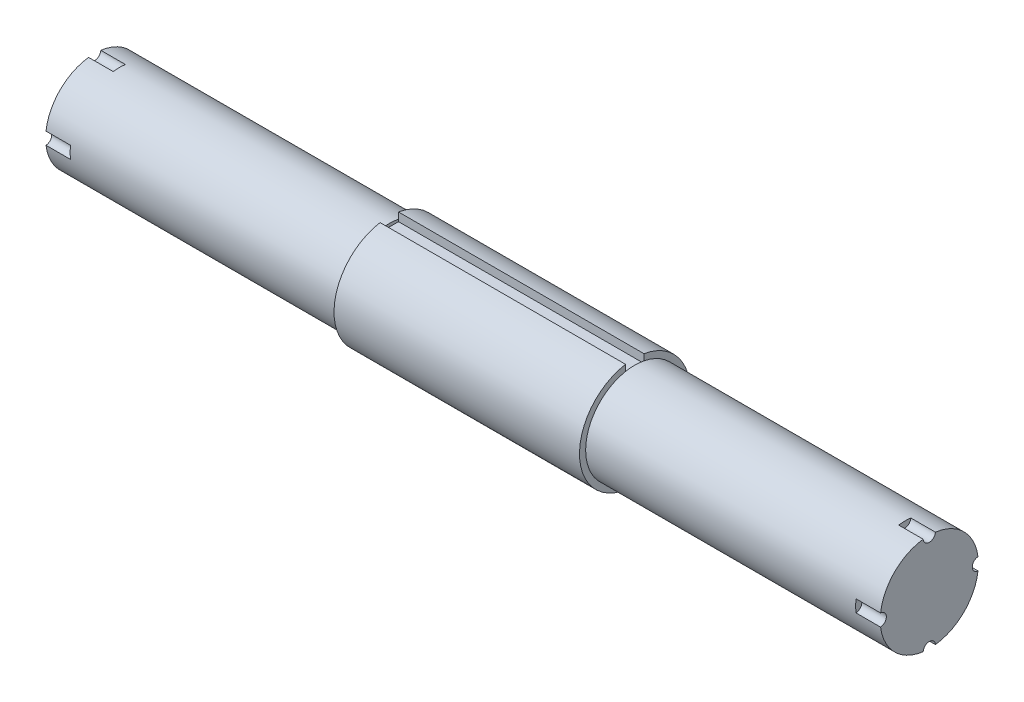
ISO-10303-21;
HEADER;
FILE_DESCRIPTION(('STEP AP214'),'2;1');
FILE_NAME('part.step','',(''),(''),'','','');
FILE_SCHEMA(('AUTOMOTIVE_DESIGN { 1 0 10303 214 1 1 1 1 }'));
ENDSEC;
DATA;
#1=APPLICATION_CONTEXT('core data for automotive mechanical design processes');
#2=APPLICATION_PROTOCOL_DEFINITION('international standard','automotive_design',2000,#1);
#3=PRODUCT_CONTEXT('',#1,'mechanical');
#4=PRODUCT('Part','Part','',(#3));
#5=PRODUCT_RELATED_PRODUCT_CATEGORY('part','',(#4));
#6=PRODUCT_DEFINITION_FORMATION('','',#4);
#7=PRODUCT_DEFINITION_CONTEXT('part definition',#1,'design');
#8=PRODUCT_DEFINITION('design','',#6,#7);
#9=PRODUCT_DEFINITION_SHAPE('','',#8);
#10=(LENGTH_UNIT() NAMED_UNIT(*) SI_UNIT(.MILLI.,.METRE.));
#11=(NAMED_UNIT(*) PLANE_ANGLE_UNIT() SI_UNIT($,.RADIAN.));
#12=(NAMED_UNIT(*) SI_UNIT($,.STERADIAN.) SOLID_ANGLE_UNIT());
#13=UNCERTAINTY_MEASURE_WITH_UNIT(LENGTH_MEASURE(1.E-05),#10,'distance_accuracy_value','');
#14=(GEOMETRIC_REPRESENTATION_CONTEXT(3) GLOBAL_UNCERTAINTY_ASSIGNED_CONTEXT((#13)) GLOBAL_UNIT_ASSIGNED_CONTEXT((#10,
#11,#12)) REPRESENTATION_CONTEXT('',''));
#15=CARTESIAN_POINT('',(0.,0.,0.));
#16=DIRECTION('',(0.,0.,1.));
#17=DIRECTION('',(1.,0.,0.));
#18=AXIS2_PLACEMENT_3D('',#15,#16,#17);
#19=CARTESIAN_POINT('',(-107.95,0.,0.));
#20=DIRECTION('',(1.,0.,0.));
#21=DIRECTION('',(0.,0.,-1.));
#22=AXIS2_PLACEMENT_3D('',#19,#20,#21);
#23=CYLINDRICAL_SURFACE('',#22,12.7);
#24=CARTESIAN_POINT('',(-31.75,0.,0.));
#25=DIRECTION('',(-1.,0.,0.));
#26=DIRECTION('',(0.,0.,1.));
#27=AXIS2_PLACEMENT_3D('',#24,#25,#26);
#28=CIRCLE('',#27,12.7);
#29=CARTESIAN_POINT('',(-31.75,12.474760456117,2.38125));
#30=VERTEX_POINT('',#29);
#31=CARTESIAN_POINT('',(-31.75,12.474760456117,-2.38125));
#32=VERTEX_POINT('',#31);
#33=EDGE_CURVE('E276',#30,#32,#28,.T.);
#34=ORIENTED_EDGE('',*,*,#33,.T.);
#35=EDGE_CURVE('E283',#32,#30,#28,.T.);
#36=ORIENTED_EDGE('',*,*,#35,.T.);
#37=EDGE_LOOP('',(#34,#36));
#38=FACE_BOUND('',#37,.T.);
#39=DIRECTION('',(-1.,0.,0.));
#40=VECTOR('',#39,1.);
#41=CARTESIAN_POINT('',(-104.775,1.5843963802183,-12.60078125));
#42=LINE('',#41,#40);
#43=CARTESIAN_POINT('',(-107.95,1.5843963802183,-12.60078125));
#44=VERTEX_POINT('',#43);
#45=CARTESIAN_POINT('',(-101.6,1.5843963802183,-12.60078125));
#46=VERTEX_POINT('',#45);
#47=EDGE_CURVE('E185',#44,#46,#42,.F.);
#48=ORIENTED_EDGE('',*,*,#47,.F.);
#49=CARTESIAN_POINT('',(-107.95,0.,0.));
#50=DIRECTION('',(-1.,0.,0.));
#51=DIRECTION('',(0.,0.,1.));
#52=AXIS2_PLACEMENT_3D('',#49,#50,#51);
#53=CIRCLE('',#52,12.7);
#54=CARTESIAN_POINT('',(-107.95,12.60078125,-1.58439638021818));
#55=VERTEX_POINT('',#54);
#56=EDGE_CURVE('E277',#55,#44,#53,.T.);
#57=ORIENTED_EDGE('',*,*,#56,.F.);
#58=DIRECTION('',(-1.,0.,0.));
#59=VECTOR('',#58,1.);
#60=CARTESIAN_POINT('',(-104.775,12.60078125,-1.58439638021817));
#61=LINE('',#60,#59);
#62=CARTESIAN_POINT('',(-101.6,12.60078125,-1.58439638021817));
#63=VERTEX_POINT('',#62);
#64=EDGE_CURVE('E225',#63,#55,#61,.T.);
#65=ORIENTED_EDGE('',*,*,#64,.F.);
#66=CARTESIAN_POINT('',(-101.6,0.,0.));
#67=DIRECTION('',(-1.,0.,0.));
#68=DIRECTION('',(0.,0.,1.));
#69=AXIS2_PLACEMENT_3D('',#66,#67,#68);
#70=CIRCLE('',#69,12.7);
#71=CARTESIAN_POINT('',(-101.6,12.60078125,1.58439638021817));
#72=VERTEX_POINT('',#71);
#73=EDGE_CURVE('E336',#72,#63,#70,.T.);
#74=ORIENTED_EDGE('',*,*,#73,.F.);
#75=DIRECTION('',(-1.,0.,0.));
#76=VECTOR('',#75,1.);
#77=CARTESIAN_POINT('',(-104.775,12.60078125,1.58439638021817));
#78=LINE('',#77,#76);
#79=CARTESIAN_POINT('',(-107.95,12.60078125,1.58439638021817));
#80=VERTEX_POINT('',#79);
#81=EDGE_CURVE('E229',#80,#72,#78,.F.);
#82=ORIENTED_EDGE('',*,*,#81,.F.);
#83=CARTESIAN_POINT('',(-107.95,1.58439638021813,12.60078125));
#84=VERTEX_POINT('',#83);
#85=EDGE_CURVE('E280',#84,#80,#53,.T.);
#86=ORIENTED_EDGE('',*,*,#85,.F.);
#87=DIRECTION('',(-1.,0.,0.));
#88=VECTOR('',#87,1.);
#89=CARTESIAN_POINT('',(-104.775,1.58439638021813,12.60078125));
#90=LINE('',#89,#88);
#91=CARTESIAN_POINT('',(-101.6,1.58439638021813,12.60078125));
#92=VERTEX_POINT('',#91);
#93=EDGE_CURVE('E215',#92,#84,#90,.T.);
#94=ORIENTED_EDGE('',*,*,#93,.F.);
#95=CARTESIAN_POINT('',(-101.6,0.,0.));
#96=DIRECTION('',(-1.,0.,0.));
#97=DIRECTION('',(0.,0.,1.));
#98=AXIS2_PLACEMENT_3D('',#95,#96,#97);
#99=CIRCLE('',#98,12.7);
#100=CARTESIAN_POINT('',(-101.6,-1.58439638021821,12.60078125));
#101=VERTEX_POINT('',#100);
#102=EDGE_CURVE('E338',#101,#92,#99,.T.);
#103=ORIENTED_EDGE('',*,*,#102,.F.);
#104=DIRECTION('',(-1.,0.,0.));
#105=VECTOR('',#104,1.);
#106=CARTESIAN_POINT('',(-104.775,-1.58439638021821,12.60078125));
#107=LINE('',#106,#105);
#108=CARTESIAN_POINT('',(-107.95,-1.58439638021821,12.60078125));
#109=VERTEX_POINT('',#108);
#110=EDGE_CURVE('E219',#109,#101,#107,.F.);
#111=ORIENTED_EDGE('',*,*,#110,.F.);
#112=CARTESIAN_POINT('',(-107.95,-12.60078125,1.58439638021818));
#113=VERTEX_POINT('',#112);
#114=EDGE_CURVE('E346',#113,#109,#53,.T.);
#115=ORIENTED_EDGE('',*,*,#114,.F.);
#116=DIRECTION('',(-1.,0.,0.));
#117=VECTOR('',#116,1.);
#118=CARTESIAN_POINT('',(-104.775,-12.60078125,1.58439638021817));
#119=LINE('',#118,#117);
#120=CARTESIAN_POINT('',(-101.6,-12.60078125,1.58439638021817));
#121=VERTEX_POINT('',#120);
#122=EDGE_CURVE('E59',#121,#113,#119,.T.);
#123=ORIENTED_EDGE('',*,*,#122,.F.);
#124=CARTESIAN_POINT('',(-101.6,0.,0.));
#125=DIRECTION('',(-1.,0.,0.));
#126=DIRECTION('',(0.,0.,1.));
#127=AXIS2_PLACEMENT_3D('',#124,#125,#126);
#128=CIRCLE('',#127,12.7);
#129=CARTESIAN_POINT('',(-101.6,-12.60078125,-1.58439638021817));
#130=VERTEX_POINT('',#129);
#131=EDGE_CURVE('E44',#130,#121,#128,.T.);
#132=ORIENTED_EDGE('',*,*,#131,.F.);
#133=DIRECTION('',(-1.,0.,0.));
#134=VECTOR('',#133,1.);
#135=CARTESIAN_POINT('',(-104.775,-12.60078125,-1.58439638021817));
#136=LINE('',#135,#134);
#137=CARTESIAN_POINT('',(-107.95,-12.60078125,-1.58439638021817));
#138=VERTEX_POINT('',#137);
#139=EDGE_CURVE('E209',#138,#130,#136,.F.);
#140=ORIENTED_EDGE('',*,*,#139,.F.);
#141=CARTESIAN_POINT('',(-107.95,-1.58439638021805,-12.60078125));
#142=VERTEX_POINT('',#141);
#143=EDGE_CURVE('E201',#142,#138,#53,.T.);
#144=ORIENTED_EDGE('',*,*,#143,.F.);
#145=DIRECTION('',(-1.,0.,0.));
#146=VECTOR('',#145,1.);
#147=CARTESIAN_POINT('',(-104.775,-1.58439638021804,-12.60078125));
#148=LINE('',#147,#146);
#149=CARTESIAN_POINT('',(-101.6,-1.58439638021804,-12.60078125));
#150=VERTEX_POINT('',#149);
#151=EDGE_CURVE('E51',#150,#142,#148,.T.);
#152=ORIENTED_EDGE('',*,*,#151,.F.);
#153=CARTESIAN_POINT('',(-101.6,0.,0.));
#154=DIRECTION('',(-1.,0.,0.));
#155=DIRECTION('',(0.,0.,1.));
#156=AXIS2_PLACEMENT_3D('',#153,#154,#155);
#157=CIRCLE('',#156,12.7);
#158=EDGE_CURVE('E11',#46,#150,#157,.T.);
#159=ORIENTED_EDGE('',*,*,#158,.F.);
#160=EDGE_LOOP('',(#48,#57,#65,#74,#82,#86,#94,#103,#111,#115,#123,#132,#140,#144,#152,#159));
#161=FACE_BOUND('',#160,.T.);
#162=ADVANCED_FACE('F36',(#38,#161),#23,.T.);
#163=CARTESIAN_POINT('',(-107.95,0.,0.));
#164=DIRECTION('',(-1.,0.,0.));
#165=DIRECTION('',(0.,0.,1.));
#166=AXIS2_PLACEMENT_3D('',#163,#164,#165);
#167=PLANE('',#166);
#168=ORIENTED_EDGE('',*,*,#56,.T.);
#169=CARTESIAN_POINT('',(-107.95,1.33025439009923E-13,-12.7));
#170=DIRECTION('',(1.,0.,0.));
#171=DIRECTION('',(0.,-1.,0.));
#172=AXIS2_PLACEMENT_3D('',#169,#170,#171);
#173=CIRCLE('',#172,1.5875);
#174=EDGE_CURVE('E189',#44,#142,#173,.T.);
#175=ORIENTED_EDGE('',*,*,#174,.T.);
#176=ORIENTED_EDGE('',*,*,#143,.T.);
#177=CARTESIAN_POINT('',(-107.95,-12.7,0.));
#178=DIRECTION('',(1.,0.,0.));
#179=DIRECTION('',(0.,0.,1.));
#180=AXIS2_PLACEMENT_3D('',#177,#178,#179);
#181=CIRCLE('',#180,1.5875);
#182=EDGE_CURVE('E194',#138,#113,#181,.T.);
#183=ORIENTED_EDGE('',*,*,#182,.T.);
#184=ORIENTED_EDGE('',*,*,#114,.T.);
#185=CARTESIAN_POINT('',(-107.95,0.,12.7));
#186=DIRECTION('',(1.,0.,0.));
#187=DIRECTION('',(0.,1.,0.));
#188=AXIS2_PLACEMENT_3D('',#185,#186,#187);
#189=CIRCLE('',#188,1.5875);
#190=EDGE_CURVE('E211',#109,#84,#189,.T.);
#191=ORIENTED_EDGE('',*,*,#190,.T.);
#192=ORIENTED_EDGE('',*,*,#85,.T.);
#193=CARTESIAN_POINT('',(-107.95,12.7,0.));
#194=DIRECTION('',(1.,0.,0.));
#195=DIRECTION('',(0.,0.,-1.));
#196=AXIS2_PLACEMENT_3D('',#193,#194,#195);
#197=CIRCLE('',#196,1.5875);
#198=EDGE_CURVE('E221',#80,#55,#197,.T.);
#199=ORIENTED_EDGE('',*,*,#198,.T.);
#200=EDGE_LOOP('',(#168,#175,#176,#183,#184,#191,#192,#199));
#201=FACE_BOUND('',#200,.T.);
#202=ADVANCED_FACE('F352',(#201),#167,.T.);
#203=CARTESIAN_POINT('',(-31.75,0.,0.));
#204=DIRECTION('',(1.,0.,0.));
#205=DIRECTION('',(0.,0.,-1.));
#206=AXIS2_PLACEMENT_3D('',#203,#204,#205);
#207=PLANE('',#206);
#208=ORIENTED_EDGE('',*,*,#35,.F.);
#209=DIRECTION('',(0.,1.,0.));
#210=VECTOR('',#209,1.);
#211=CARTESIAN_POINT('',(-31.75,11.90625,-2.38125));
#212=LINE('',#211,#210);
#213=CARTESIAN_POINT('',(-31.75,14.087664983506,-2.38125));
#214=VERTEX_POINT('',#213);
#215=EDGE_CURVE('E296',#32,#214,#212,.T.);
#216=ORIENTED_EDGE('',*,*,#215,.T.);
#217=CARTESIAN_POINT('',(-31.75,0.,0.));
#218=DIRECTION('',(1.,0.,0.));
#219=DIRECTION('',(0.,0.,-1.));
#220=AXIS2_PLACEMENT_3D('',#217,#218,#219);
#221=CIRCLE('',#220,14.2875);
#222=CARTESIAN_POINT('',(-31.75,14.087664983506,2.38125));
#223=VERTEX_POINT('',#222);
#224=EDGE_CURVE('E316',#223,#214,#221,.T.);
#225=ORIENTED_EDGE('',*,*,#224,.F.);
#226=DIRECTION('',(0.,-1.,0.));
#227=VECTOR('',#226,1.);
#228=CARTESIAN_POINT('',(-31.75,11.90625,2.38125));
#229=LINE('',#228,#227);
#230=EDGE_CURVE('E302',#223,#30,#229,.T.);
#231=ORIENTED_EDGE('',*,*,#230,.T.);
#232=EDGE_LOOP('',(#208,#216,#225,#231));
#233=FACE_BOUND('',#232,.T.);
#234=ADVANCED_FACE('F381',(#233),#207,.F.);
#235=CARTESIAN_POINT('',(31.75,0.,0.));
#236=DIRECTION('',(-1.,0.,0.));
#237=DIRECTION('',(0.,0.,1.));
#238=AXIS2_PLACEMENT_3D('',#235,#236,#237);
#239=CYLINDRICAL_SURFACE('',#238,14.2875);
#240=CARTESIAN_POINT('',(31.75,0.,0.));
#241=DIRECTION('',(1.,0.,0.));
#242=DIRECTION('',(0.,0.,-1.));
#243=AXIS2_PLACEMENT_3D('',#240,#241,#242);
#244=CIRCLE('',#243,14.2875);
#245=CARTESIAN_POINT('',(31.75,14.087664983506,2.38125));
#246=VERTEX_POINT('',#245);
#247=CARTESIAN_POINT('',(31.75,14.087664983506,-2.38125));
#248=VERTEX_POINT('',#247);
#249=EDGE_CURVE('E323',#246,#248,#244,.T.);
#250=ORIENTED_EDGE('',*,*,#249,.F.);
#251=DIRECTION('',(1.,0.,0.));
#252=VECTOR('',#251,1.);
#253=CARTESIAN_POINT('',(-31.75,14.087664983506,2.38125));
#254=LINE('',#253,#252);
#255=EDGE_CURVE('E317',#223,#246,#254,.T.);
#256=ORIENTED_EDGE('',*,*,#255,.F.);
#257=ORIENTED_EDGE('',*,*,#224,.T.);
#258=DIRECTION('',(1.,0.,0.));
#259=VECTOR('',#258,1.);
#260=CARTESIAN_POINT('',(-31.75,14.087664983506,-2.38125));
#261=LINE('',#260,#259);
#262=EDGE_CURVE('E319',#214,#248,#261,.T.);
#263=ORIENTED_EDGE('',*,*,#262,.T.);
#264=EDGE_LOOP('',(#250,#256,#257,#263));
#265=FACE_BOUND('',#264,.T.);
#266=ADVANCED_FACE('F38',(#265),#239,.T.);
#267=CARTESIAN_POINT('',(31.75,0.,0.));
#268=DIRECTION('',(1.,0.,0.));
#269=DIRECTION('',(0.,0.,-1.));
#270=AXIS2_PLACEMENT_3D('',#267,#268,#269);
#271=PLANE('',#270);
#272=CARTESIAN_POINT('',(31.75,0.,0.));
#273=DIRECTION('',(1.,0.,0.));
#274=DIRECTION('',(0.,0.,-1.));
#275=AXIS2_PLACEMENT_3D('',#272,#273,#274);
#276=CIRCLE('',#275,12.7);
#277=CARTESIAN_POINT('',(31.75,12.474760456117,2.38125));
#278=VERTEX_POINT('',#277);
#279=CARTESIAN_POINT('',(31.75,12.474760456117,-2.38125));
#280=VERTEX_POINT('',#279);
#281=EDGE_CURVE('E292',#278,#280,#276,.T.);
#282=ORIENTED_EDGE('',*,*,#281,.F.);
#283=DIRECTION('',(0.,-1.,0.));
#284=VECTOR('',#283,1.);
#285=CARTESIAN_POINT('',(31.75,11.90625,2.38125));
#286=LINE('',#285,#284);
#287=EDGE_CURVE('E297',#246,#278,#286,.T.);
#288=ORIENTED_EDGE('',*,*,#287,.F.);
#289=ORIENTED_EDGE('',*,*,#249,.T.);
#290=DIRECTION('',(0.,1.,0.));
#291=VECTOR('',#290,1.);
#292=CARTESIAN_POINT('',(31.75,11.90625,-2.38125));
#293=LINE('',#292,#291);
#294=EDGE_CURVE('E307',#280,#248,#293,.T.);
#295=ORIENTED_EDGE('',*,*,#294,.F.);
#296=EDGE_LOOP('',(#282,#288,#289,#295));
#297=FACE_BOUND('',#296,.T.);
#298=ADVANCED_FACE('F403',(#297),#271,.T.);
#299=CARTESIAN_POINT('',(-31.75,11.90625,2.38125));
#300=DIRECTION('',(0.,0.,1.));
#301=DIRECTION('',(1.,0.,0.));
#302=AXIS2_PLACEMENT_3D('',#299,#300,#301);
#303=PLANE('',#302);
#304=ORIENTED_EDGE('',*,*,#287,.T.);
#305=CARTESIAN_POINT('',(31.75,11.90625,2.38125));
#306=VERTEX_POINT('',#305);
#307=EDGE_CURVE('E310',#278,#306,#286,.T.);
#308=ORIENTED_EDGE('',*,*,#307,.T.);
#309=DIRECTION('',(1.,0.,0.));
#310=VECTOR('',#309,1.);
#311=CARTESIAN_POINT('',(-31.75,11.90625,2.38125));
#312=LINE('',#311,#310);
#313=CARTESIAN_POINT('',(-31.75,11.90625,2.38125));
#314=VERTEX_POINT('',#313);
#315=EDGE_CURVE('E313',#314,#306,#312,.T.);
#316=ORIENTED_EDGE('',*,*,#315,.F.);
#317=EDGE_CURVE('E301',#30,#314,#229,.T.);
#318=ORIENTED_EDGE('',*,*,#317,.F.);
#319=ORIENTED_EDGE('',*,*,#230,.F.);
#320=ORIENTED_EDGE('',*,*,#255,.T.);
#321=EDGE_LOOP('',(#304,#308,#316,#318,#319,#320));
#322=FACE_BOUND('',#321,.T.);
#323=ADVANCED_FACE('F399',(#322),#303,.F.);
#324=CARTESIAN_POINT('',(-31.75,11.90625,-2.38125));
#325=DIRECTION('',(0.,0.,-1.));
#326=DIRECTION('',(-1.,0.,0.));
#327=AXIS2_PLACEMENT_3D('',#324,#325,#326);
#328=PLANE('',#327);
#329=CARTESIAN_POINT('',(31.75,11.90625,-2.38125));
#330=VERTEX_POINT('',#329);
#331=EDGE_CURVE('E308',#330,#280,#293,.T.);
#332=ORIENTED_EDGE('',*,*,#331,.T.);
#333=ORIENTED_EDGE('',*,*,#294,.T.);
#334=ORIENTED_EDGE('',*,*,#262,.F.);
#335=ORIENTED_EDGE('',*,*,#215,.F.);
#336=CARTESIAN_POINT('',(-31.75,11.90625,-2.38125));
#337=VERTEX_POINT('',#336);
#338=EDGE_CURVE('E298',#337,#32,#212,.T.);
#339=ORIENTED_EDGE('',*,*,#338,.F.);
#340=DIRECTION('',(1.,0.,0.));
#341=VECTOR('',#340,1.);
#342=CARTESIAN_POINT('',(-31.75,11.90625,-2.38125));
#343=LINE('',#342,#341);
#344=EDGE_CURVE('E304',#337,#330,#343,.T.);
#345=ORIENTED_EDGE('',*,*,#344,.T.);
#346=EDGE_LOOP('',(#332,#333,#334,#335,#339,#345));
#347=FACE_BOUND('',#346,.T.);
#348=ADVANCED_FACE('F402',(#347),#328,.F.);
#349=CARTESIAN_POINT('',(-31.75,11.90625,0.));
#350=DIRECTION('',(0.,-1.,0.));
#351=DIRECTION('',(0.,0.,-1.));
#352=AXIS2_PLACEMENT_3D('',#349,#350,#351);
#353=PLANE('',#352);
#354=DIRECTION('',(0.,0.,-1.));
#355=VECTOR('',#354,1.);
#356=CARTESIAN_POINT('',(31.75,11.90625,0.));
#357=LINE('',#356,#355);
#358=EDGE_CURVE('E287',#306,#330,#357,.T.);
#359=ORIENTED_EDGE('',*,*,#358,.T.);
#360=ORIENTED_EDGE('',*,*,#344,.F.);
#361=DIRECTION('',(0.,0.,-1.));
#362=VECTOR('',#361,1.);
#363=CARTESIAN_POINT('',(-31.75,11.90625,0.));
#364=LINE('',#363,#362);
#365=EDGE_CURVE('E293',#314,#337,#364,.T.);
#366=ORIENTED_EDGE('',*,*,#365,.F.);
#367=ORIENTED_EDGE('',*,*,#315,.T.);
#368=EDGE_LOOP('',(#359,#360,#366,#367));
#369=FACE_BOUND('',#368,.T.);
#370=ADVANCED_FACE('F397',(#369),#353,.F.);
#371=CARTESIAN_POINT('',(107.95,0.,0.));
#372=DIRECTION('',(-1.,0.,0.));
#373=DIRECTION('',(0.,0.,1.));
#374=AXIS2_PLACEMENT_3D('',#371,#372,#373);
#375=CYLINDRICAL_SURFACE('',#374,12.7);
#376=CARTESIAN_POINT('',(101.6,0.,0.));
#377=DIRECTION('',(1.,0.,0.));
#378=DIRECTION('',(0.,0.,-1.));
#379=AXIS2_PLACEMENT_3D('',#376,#377,#378);
#380=CIRCLE('',#379,12.7);
#381=CARTESIAN_POINT('',(101.6,-1.58439638021804,-12.60078125));
#382=VERTEX_POINT('',#381);
#383=CARTESIAN_POINT('',(101.6,1.5843963802183,-12.60078125));
#384=VERTEX_POINT('',#383);
#385=EDGE_CURVE('E334',#382,#384,#380,.T.);
#386=ORIENTED_EDGE('',*,*,#385,.F.);
#387=DIRECTION('',(1.,0.,0.));
#388=VECTOR('',#387,1.);
#389=CARTESIAN_POINT('',(104.775,-1.58439638021804,-12.60078125));
#390=LINE('',#389,#388);
#391=CARTESIAN_POINT('',(107.95,-1.58439638021804,-12.60078125));
#392=VERTEX_POINT('',#391);
#393=EDGE_CURVE('E239',#382,#392,#390,.T.);
#394=ORIENTED_EDGE('',*,*,#393,.T.);
#395=CARTESIAN_POINT('',(107.95,0.,0.));
#396=DIRECTION('',(1.,0.,0.));
#397=DIRECTION('',(0.,0.,-1.));
#398=AXIS2_PLACEMENT_3D('',#395,#396,#397);
#399=CIRCLE('',#398,12.7);
#400=CARTESIAN_POINT('',(107.95,-12.60078125,-1.58439638021818));
#401=VERTEX_POINT('',#400);
#402=EDGE_CURVE('E479',#401,#392,#399,.T.);
#403=ORIENTED_EDGE('',*,*,#402,.F.);
#404=DIRECTION('',(1.,0.,0.));
#405=VECTOR('',#404,1.);
#406=CARTESIAN_POINT('',(104.775,-12.60078125,-1.58439638021817));
#407=LINE('',#406,#405);
#408=CARTESIAN_POINT('',(101.6,-12.60078125,-1.58439638021817));
#409=VERTEX_POINT('',#408);
#410=EDGE_CURVE('E246',#401,#409,#407,.F.);
#411=ORIENTED_EDGE('',*,*,#410,.T.);
#412=CARTESIAN_POINT('',(101.6,0.,0.));
#413=DIRECTION('',(1.,0.,0.));
#414=DIRECTION('',(0.,0.,-1.));
#415=AXIS2_PLACEMENT_3D('',#412,#413,#414);
#416=CIRCLE('',#415,12.7);
#417=CARTESIAN_POINT('',(101.6,-12.60078125,1.58439638021817));
#418=VERTEX_POINT('',#417);
#419=EDGE_CURVE('E332',#418,#409,#416,.T.);
#420=ORIENTED_EDGE('',*,*,#419,.F.);
#421=DIRECTION('',(1.,0.,0.));
#422=VECTOR('',#421,1.);
#423=CARTESIAN_POINT('',(104.775,-12.60078125,1.58439638021817));
#424=LINE('',#423,#422);
#425=CARTESIAN_POINT('',(107.95,-12.60078125,1.58439638021817));
#426=VERTEX_POINT('',#425);
#427=EDGE_CURVE('E250',#418,#426,#424,.T.);
#428=ORIENTED_EDGE('',*,*,#427,.T.);
#429=CARTESIAN_POINT('',(107.95,-1.58439638021822,12.60078125));
#430=VERTEX_POINT('',#429);
#431=EDGE_CURVE('E288',#430,#426,#399,.T.);
#432=ORIENTED_EDGE('',*,*,#431,.F.);
#433=DIRECTION('',(1.,0.,0.));
#434=VECTOR('',#433,1.);
#435=CARTESIAN_POINT('',(104.775,-1.58439638021821,12.60078125));
#436=LINE('',#435,#434);
#437=CARTESIAN_POINT('',(101.6,-1.58439638021821,12.60078125));
#438=VERTEX_POINT('',#437);
#439=EDGE_CURVE('E257',#430,#438,#436,.F.);
#440=ORIENTED_EDGE('',*,*,#439,.T.);
#441=CARTESIAN_POINT('',(101.6,0.,0.));
#442=DIRECTION('',(1.,0.,0.));
#443=DIRECTION('',(0.,0.,-1.));
#444=AXIS2_PLACEMENT_3D('',#441,#442,#443);
#445=CIRCLE('',#444,12.7);
#446=CARTESIAN_POINT('',(101.6,1.58439638021813,12.60078125));
#447=VERTEX_POINT('',#446);
#448=EDGE_CURVE('E330',#447,#438,#445,.T.);
#449=ORIENTED_EDGE('',*,*,#448,.F.);
#450=DIRECTION('',(1.,0.,0.));
#451=VECTOR('',#450,1.);
#452=CARTESIAN_POINT('',(104.775,1.58439638021813,12.60078125));
#453=LINE('',#452,#451);
#454=CARTESIAN_POINT('',(107.95,1.58439638021813,12.60078125));
#455=VERTEX_POINT('',#454);
#456=EDGE_CURVE('E261',#447,#455,#453,.T.);
#457=ORIENTED_EDGE('',*,*,#456,.T.);
#458=CARTESIAN_POINT('',(107.95,12.60078125,1.58439638021818));
#459=VERTEX_POINT('',#458);
#460=EDGE_CURVE('E284',#459,#455,#399,.T.);
#461=ORIENTED_EDGE('',*,*,#460,.F.);
#462=DIRECTION('',(1.,0.,0.));
#463=VECTOR('',#462,1.);
#464=CARTESIAN_POINT('',(104.775,12.60078125,1.58439638021817));
#465=LINE('',#464,#463);
#466=CARTESIAN_POINT('',(101.6,12.60078125,1.58439638021817));
#467=VERTEX_POINT('',#466);
#468=EDGE_CURVE('E268',#459,#467,#465,.F.);
#469=ORIENTED_EDGE('',*,*,#468,.T.);
#470=CARTESIAN_POINT('',(101.6,0.,0.));
#471=DIRECTION('',(1.,0.,0.));
#472=DIRECTION('',(0.,0.,-1.));
#473=AXIS2_PLACEMENT_3D('',#470,#471,#472);
#474=CIRCLE('',#473,12.7);
#475=CARTESIAN_POINT('',(101.6,12.60078125,-1.58439638021817));
#476=VERTEX_POINT('',#475);
#477=EDGE_CURVE('E328',#476,#467,#474,.T.);
#478=ORIENTED_EDGE('',*,*,#477,.F.);
#479=DIRECTION('',(1.,0.,0.));
#480=VECTOR('',#479,1.);
#481=CARTESIAN_POINT('',(104.775,12.60078125,-1.58439638021817));
#482=LINE('',#481,#480);
#483=CARTESIAN_POINT('',(107.95,12.60078125,-1.58439638021817));
#484=VERTEX_POINT('',#483);
#485=EDGE_CURVE('E273',#476,#484,#482,.T.);
#486=ORIENTED_EDGE('',*,*,#485,.T.);
#487=CARTESIAN_POINT('',(107.95,1.58439638021831,-12.60078125));
#488=VERTEX_POINT('',#487);
#489=EDGE_CURVE('E289',#488,#484,#399,.T.);
#490=ORIENTED_EDGE('',*,*,#489,.F.);
#491=DIRECTION('',(1.,0.,0.));
#492=VECTOR('',#491,1.);
#493=CARTESIAN_POINT('',(104.775,1.5843963802183,-12.60078125));
#494=LINE('',#493,#492);
#495=EDGE_CURVE('E235',#488,#384,#494,.F.);
#496=ORIENTED_EDGE('',*,*,#495,.T.);
#497=EDGE_LOOP('',(#386,#394,#403,#411,#420,#428,#432,#440,#449,#457,#461,#469,#478,#486,#490,#496));
#498=FACE_BOUND('',#497,.T.);
#499=EDGE_CURVE('E279',#280,#278,#276,.T.);
#500=ORIENTED_EDGE('',*,*,#499,.T.);
#501=ORIENTED_EDGE('',*,*,#281,.T.);
#502=EDGE_LOOP('',(#500,#501));
#503=FACE_BOUND('',#502,.T.);
#504=ADVANCED_FACE('F390',(#498,#503),#375,.T.);
#505=CARTESIAN_POINT('',(107.95,0.,0.));
#506=DIRECTION('',(1.,0.,0.));
#507=DIRECTION('',(0.,0.,-1.));
#508=AXIS2_PLACEMENT_3D('',#505,#506,#507);
#509=PLANE('',#508);
#510=CARTESIAN_POINT('',(107.95,1.33025439009923E-13,-12.7));
#511=DIRECTION('',(1.,0.,0.));
#512=DIRECTION('',(0.,-1.,0.));
#513=AXIS2_PLACEMENT_3D('',#510,#511,#512);
#514=CIRCLE('',#513,1.5875);
#515=EDGE_CURVE('E231',#488,#392,#514,.T.);
#516=ORIENTED_EDGE('',*,*,#515,.F.);
#517=ORIENTED_EDGE('',*,*,#489,.T.);
#518=CARTESIAN_POINT('',(107.95,12.7,0.));
#519=DIRECTION('',(1.,0.,0.));
#520=DIRECTION('',(0.,0.,-1.));
#521=AXIS2_PLACEMENT_3D('',#518,#519,#520);
#522=CIRCLE('',#521,1.5875);
#523=EDGE_CURVE('E264',#459,#484,#522,.T.);
#524=ORIENTED_EDGE('',*,*,#523,.F.);
#525=ORIENTED_EDGE('',*,*,#460,.T.);
#526=CARTESIAN_POINT('',(107.95,0.,12.7));
#527=DIRECTION('',(1.,0.,0.));
#528=DIRECTION('',(0.,1.,0.));
#529=AXIS2_PLACEMENT_3D('',#526,#527,#528);
#530=CIRCLE('',#529,1.5875);
#531=EDGE_CURVE('E253',#430,#455,#530,.T.);
#532=ORIENTED_EDGE('',*,*,#531,.F.);
#533=ORIENTED_EDGE('',*,*,#431,.T.);
#534=CARTESIAN_POINT('',(107.95,-12.7,0.));
#535=DIRECTION('',(1.,0.,0.));
#536=DIRECTION('',(0.,0.,1.));
#537=AXIS2_PLACEMENT_3D('',#534,#535,#536);
#538=CIRCLE('',#537,1.5875);
#539=EDGE_CURVE('E242',#401,#426,#538,.T.);
#540=ORIENTED_EDGE('',*,*,#539,.F.);
#541=ORIENTED_EDGE('',*,*,#402,.T.);
#542=EDGE_LOOP('',(#516,#517,#524,#525,#532,#533,#540,#541));
#543=FACE_BOUND('',#542,.T.);
#544=ADVANCED_FACE('F386',(#543),#509,.T.);
#545=CARTESIAN_POINT('',(31.75,0.,0.));
#546=DIRECTION('',(1.,0.,0.));
#547=DIRECTION('',(0.,0.,-1.));
#548=AXIS2_PLACEMENT_3D('',#545,#546,#547);
#549=PLANE('',#548);
#550=ORIENTED_EDGE('',*,*,#307,.F.);
#551=ORIENTED_EDGE('',*,*,#499,.F.);
#552=ORIENTED_EDGE('',*,*,#331,.F.);
#553=ORIENTED_EDGE('',*,*,#358,.F.);
#554=EDGE_LOOP('',(#550,#551,#552,#553));
#555=FACE_BOUND('',#554,.T.);
#556=ADVANCED_FACE('F389',(#555),#549,.F.);
#557=CARTESIAN_POINT('',(-31.75,0.,0.));
#558=DIRECTION('',(-1.,0.,0.));
#559=DIRECTION('',(0.,0.,1.));
#560=AXIS2_PLACEMENT_3D('',#557,#558,#559);
#561=PLANE('',#560);
#562=ORIENTED_EDGE('',*,*,#33,.F.);
#563=ORIENTED_EDGE('',*,*,#317,.T.);
#564=ORIENTED_EDGE('',*,*,#365,.T.);
#565=ORIENTED_EDGE('',*,*,#338,.T.);
#566=EDGE_LOOP('',(#562,#563,#564,#565));
#567=FACE_BOUND('',#566,.T.);
#568=ADVANCED_FACE('F385',(#567),#561,.F.);
#569=CARTESIAN_POINT('',(101.6,12.7,0.));
#570=DIRECTION('',(1.,0.,0.));
#571=DIRECTION('',(0.,0.,-1.));
#572=AXIS2_PLACEMENT_3D('',#569,#570,#571);
#573=PLANE('',#572);
#574=ORIENTED_EDGE('',*,*,#477,.T.);
#575=CARTESIAN_POINT('',(101.6,12.7,0.));
#576=DIRECTION('',(1.,0.,0.));
#577=DIRECTION('',(0.,0.,-1.));
#578=AXIS2_PLACEMENT_3D('',#575,#576,#577);
#579=CIRCLE('',#578,1.5875);
#580=EDGE_CURVE('E265',#467,#476,#579,.T.);
#581=ORIENTED_EDGE('',*,*,#580,.T.);
#582=EDGE_LOOP('',(#574,#581));
#583=FACE_BOUND('',#582,.T.);
#584=ADVANCED_FACE('F440',(#583),#573,.T.);
#585=CARTESIAN_POINT('',(101.6,12.7,0.));
#586=DIRECTION('',(1.,0.,0.));
#587=DIRECTION('',(0.,0.,-1.));
#588=AXIS2_PLACEMENT_3D('',#585,#586,#587);
#589=CYLINDRICAL_SURFACE('',#588,1.5875);
#590=ORIENTED_EDGE('',*,*,#580,.F.);
#591=ORIENTED_EDGE('',*,*,#468,.F.);
#592=ORIENTED_EDGE('',*,*,#523,.T.);
#593=ORIENTED_EDGE('',*,*,#485,.F.);
#594=EDGE_LOOP('',(#590,#591,#592,#593));
#595=FACE_BOUND('',#594,.T.);
#596=ADVANCED_FACE('F444',(#595),#589,.F.);
#597=CARTESIAN_POINT('',(101.6,0.,12.7));
#598=DIRECTION('',(1.,0.,0.));
#599=DIRECTION('',(0.,1.,0.));
#600=AXIS2_PLACEMENT_3D('',#597,#598,#599);
#601=PLANE('',#600);
#602=ORIENTED_EDGE('',*,*,#448,.T.);
#603=CARTESIAN_POINT('',(101.6,0.,12.7));
#604=DIRECTION('',(1.,0.,0.));
#605=DIRECTION('',(0.,1.,0.));
#606=AXIS2_PLACEMENT_3D('',#603,#604,#605);
#607=CIRCLE('',#606,1.5875);
#608=EDGE_CURVE('E254',#438,#447,#607,.T.);
#609=ORIENTED_EDGE('',*,*,#608,.T.);
#610=EDGE_LOOP('',(#602,#609));
#611=FACE_BOUND('',#610,.T.);
#612=ADVANCED_FACE('F450',(#611),#601,.T.);
#613=CARTESIAN_POINT('',(101.6,0.,12.7));
#614=DIRECTION('',(1.,0.,0.));
#615=DIRECTION('',(0.,0.,-1.));
#616=AXIS2_PLACEMENT_3D('',#613,#614,#615);
#617=CYLINDRICAL_SURFACE('',#616,1.5875);
#618=ORIENTED_EDGE('',*,*,#608,.F.);
#619=ORIENTED_EDGE('',*,*,#439,.F.);
#620=ORIENTED_EDGE('',*,*,#531,.T.);
#621=ORIENTED_EDGE('',*,*,#456,.F.);
#622=EDGE_LOOP('',(#618,#619,#620,#621));
#623=FACE_BOUND('',#622,.T.);
#624=ADVANCED_FACE('F454',(#623),#617,.F.);
#625=CARTESIAN_POINT('',(101.6,-12.7,0.));
#626=DIRECTION('',(1.,0.,0.));
#627=DIRECTION('',(0.,0.,1.));
#628=AXIS2_PLACEMENT_3D('',#625,#626,#627);
#629=PLANE('',#628);
#630=ORIENTED_EDGE('',*,*,#419,.T.);
#631=CARTESIAN_POINT('',(101.6,-12.7,0.));
#632=DIRECTION('',(1.,0.,0.));
#633=DIRECTION('',(0.,0.,1.));
#634=AXIS2_PLACEMENT_3D('',#631,#632,#633);
#635=CIRCLE('',#634,1.5875);
#636=EDGE_CURVE('E243',#409,#418,#635,.T.);
#637=ORIENTED_EDGE('',*,*,#636,.T.);
#638=EDGE_LOOP('',(#630,#637));
#639=FACE_BOUND('',#638,.T.);
#640=ADVANCED_FACE('F457',(#639),#629,.T.);
#641=CARTESIAN_POINT('',(101.6,-12.7,0.));
#642=DIRECTION('',(1.,0.,0.));
#643=DIRECTION('',(0.,0.,-1.));
#644=AXIS2_PLACEMENT_3D('',#641,#642,#643);
#645=CYLINDRICAL_SURFACE('',#644,1.5875);
#646=ORIENTED_EDGE('',*,*,#636,.F.);
#647=ORIENTED_EDGE('',*,*,#410,.F.);
#648=ORIENTED_EDGE('',*,*,#539,.T.);
#649=ORIENTED_EDGE('',*,*,#427,.F.);
#650=EDGE_LOOP('',(#646,#647,#648,#649));
#651=FACE_BOUND('',#650,.T.);
#652=ADVANCED_FACE('F462',(#651),#645,.F.);
#653=CARTESIAN_POINT('',(101.6,1.33025439009923E-13,-12.7));
#654=DIRECTION('',(1.,0.,0.));
#655=DIRECTION('',(0.,-1.,0.));
#656=AXIS2_PLACEMENT_3D('',#653,#654,#655);
#657=PLANE('',#656);
#658=ORIENTED_EDGE('',*,*,#385,.T.);
#659=CARTESIAN_POINT('',(101.6,1.33025439009923E-13,-12.7));
#660=DIRECTION('',(1.,0.,0.));
#661=DIRECTION('',(0.,-1.,0.));
#662=AXIS2_PLACEMENT_3D('',#659,#660,#661);
#663=CIRCLE('',#662,1.5875);
#664=EDGE_CURVE('E232',#384,#382,#663,.T.);
#665=ORIENTED_EDGE('',*,*,#664,.T.);
#666=EDGE_LOOP('',(#658,#665));
#667=FACE_BOUND('',#666,.T.);
#668=ADVANCED_FACE('F371',(#667),#657,.T.);
#669=CARTESIAN_POINT('',(101.6,1.33025439009923E-13,-12.7));
#670=DIRECTION('',(1.,0.,0.));
#671=DIRECTION('',(0.,0.,-1.));
#672=AXIS2_PLACEMENT_3D('',#669,#670,#671);
#673=CYLINDRICAL_SURFACE('',#672,1.5875);
#674=ORIENTED_EDGE('',*,*,#664,.F.);
#675=ORIENTED_EDGE('',*,*,#495,.F.);
#676=ORIENTED_EDGE('',*,*,#515,.T.);
#677=ORIENTED_EDGE('',*,*,#393,.F.);
#678=EDGE_LOOP('',(#674,#675,#676,#677));
#679=FACE_BOUND('',#678,.T.);
#680=ADVANCED_FACE('F363',(#679),#673,.F.);
#681=CARTESIAN_POINT('',(-101.6,12.7,0.));
#682=DIRECTION('',(-1.,0.,0.));
#683=DIRECTION('',(0.,0.,-1.));
#684=AXIS2_PLACEMENT_3D('',#681,#682,#683);
#685=PLANE('',#684);
#686=ORIENTED_EDGE('',*,*,#73,.T.);
#687=CARTESIAN_POINT('',(-101.6,12.7,0.));
#688=DIRECTION('',(1.,0.,0.));
#689=DIRECTION('',(0.,0.,-1.));
#690=AXIS2_PLACEMENT_3D('',#687,#688,#689);
#691=CIRCLE('',#690,1.5875);
#692=EDGE_CURVE('E222',#72,#63,#691,.T.);
#693=ORIENTED_EDGE('',*,*,#692,.F.);
#694=EDGE_LOOP('',(#686,#693));
#695=FACE_BOUND('',#694,.T.);
#696=ADVANCED_FACE('F361',(#695),#685,.T.);
#697=CARTESIAN_POINT('',(-101.6,12.7,0.));
#698=DIRECTION('',(-1.,0.,0.));
#699=DIRECTION('',(0.,0.,1.));
#700=AXIS2_PLACEMENT_3D('',#697,#698,#699);
#701=CYLINDRICAL_SURFACE('',#700,1.5875);
#702=ORIENTED_EDGE('',*,*,#81,.T.);
#703=ORIENTED_EDGE('',*,*,#692,.T.);
#704=ORIENTED_EDGE('',*,*,#64,.T.);
#705=ORIENTED_EDGE('',*,*,#198,.F.);
#706=EDGE_LOOP('',(#702,#703,#704,#705));
#707=FACE_BOUND('',#706,.T.);
#708=ADVANCED_FACE('F356',(#707),#701,.F.);
#709=CARTESIAN_POINT('',(-101.6,0.,12.7));
#710=DIRECTION('',(-1.,0.,0.));
#711=DIRECTION('',(0.,1.,0.));
#712=AXIS2_PLACEMENT_3D('',#709,#710,#711);
#713=PLANE('',#712);
#714=ORIENTED_EDGE('',*,*,#102,.T.);
#715=CARTESIAN_POINT('',(-101.6,0.,12.7));
#716=DIRECTION('',(1.,0.,0.));
#717=DIRECTION('',(0.,1.,0.));
#718=AXIS2_PLACEMENT_3D('',#715,#716,#717);
#719=CIRCLE('',#718,1.5875);
#720=EDGE_CURVE('E212',#101,#92,#719,.T.);
#721=ORIENTED_EDGE('',*,*,#720,.F.);
#722=EDGE_LOOP('',(#714,#721));
#723=FACE_BOUND('',#722,.T.);
#724=ADVANCED_FACE('F369',(#723),#713,.T.);
#725=CARTESIAN_POINT('',(-101.6,0.,12.7));
#726=DIRECTION('',(-1.,0.,0.));
#727=DIRECTION('',(0.,0.,1.));
#728=AXIS2_PLACEMENT_3D('',#725,#726,#727);
#729=CYLINDRICAL_SURFACE('',#728,1.5875);
#730=ORIENTED_EDGE('',*,*,#110,.T.);
#731=ORIENTED_EDGE('',*,*,#720,.T.);
#732=ORIENTED_EDGE('',*,*,#93,.T.);
#733=ORIENTED_EDGE('',*,*,#190,.F.);
#734=EDGE_LOOP('',(#730,#731,#732,#733));
#735=FACE_BOUND('',#734,.T.);
#736=ADVANCED_FACE('F527',(#735),#729,.F.);
#737=CARTESIAN_POINT('',(-101.6,-12.7,0.));
#738=DIRECTION('',(-1.,0.,0.));
#739=DIRECTION('',(0.,0.,1.));
#740=AXIS2_PLACEMENT_3D('',#737,#738,#739);
#741=PLANE('',#740);
#742=ORIENTED_EDGE('',*,*,#131,.T.);
#743=CARTESIAN_POINT('',(-101.6,-12.7,0.));
#744=DIRECTION('',(1.,0.,0.));
#745=DIRECTION('',(0.,0.,1.));
#746=AXIS2_PLACEMENT_3D('',#743,#744,#745);
#747=CIRCLE('',#746,1.5875);
#748=EDGE_CURVE('E205',#130,#121,#747,.T.);
#749=ORIENTED_EDGE('',*,*,#748,.F.);
#750=EDGE_LOOP('',(#742,#749));
#751=FACE_BOUND('',#750,.T.);
#752=ADVANCED_FACE('F342',(#751),#741,.T.);
#753=CARTESIAN_POINT('',(-101.6,-12.7,0.));
#754=DIRECTION('',(-1.,0.,0.));
#755=DIRECTION('',(0.,0.,1.));
#756=AXIS2_PLACEMENT_3D('',#753,#754,#755);
#757=CYLINDRICAL_SURFACE('',#756,1.5875);
#758=ORIENTED_EDGE('',*,*,#139,.T.);
#759=ORIENTED_EDGE('',*,*,#748,.T.);
#760=ORIENTED_EDGE('',*,*,#122,.T.);
#761=ORIENTED_EDGE('',*,*,#182,.F.);
#762=EDGE_LOOP('',(#758,#759,#760,#761));
#763=FACE_BOUND('',#762,.T.);
#764=ADVANCED_FACE('F343',(#763),#757,.F.);
#765=CARTESIAN_POINT('',(-101.6,1.33025439009923E-13,-12.7));
#766=DIRECTION('',(-1.,0.,0.));
#767=DIRECTION('',(0.,-1.,0.));
#768=AXIS2_PLACEMENT_3D('',#765,#766,#767);
#769=PLANE('',#768);
#770=ORIENTED_EDGE('',*,*,#158,.T.);
#771=CARTESIAN_POINT('',(-101.6,1.33025439009923E-13,-12.7));
#772=DIRECTION('',(1.,0.,0.));
#773=DIRECTION('',(0.,-1.,0.));
#774=AXIS2_PLACEMENT_3D('',#771,#772,#773);
#775=CIRCLE('',#774,1.5875);
#776=EDGE_CURVE('E188',#46,#150,#775,.T.);
#777=ORIENTED_EDGE('',*,*,#776,.F.);
#778=EDGE_LOOP('',(#770,#777));
#779=FACE_BOUND('',#778,.T.);
#780=ADVANCED_FACE('F197',(#779),#769,.T.);
#781=CARTESIAN_POINT('',(-101.6,1.33025439009923E-13,-12.7));
#782=DIRECTION('',(-1.,0.,0.));
#783=DIRECTION('',(0.,0.,1.));
#784=AXIS2_PLACEMENT_3D('',#781,#782,#783);
#785=CYLINDRICAL_SURFACE('',#784,1.5875);
#786=ORIENTED_EDGE('',*,*,#47,.T.);
#787=ORIENTED_EDGE('',*,*,#776,.T.);
#788=ORIENTED_EDGE('',*,*,#151,.T.);
#789=ORIENTED_EDGE('',*,*,#174,.F.);
#790=EDGE_LOOP('',(#786,#787,#788,#789));
#791=FACE_BOUND('',#790,.T.);
#792=ADVANCED_FACE('F187',(#791),#785,.F.);
#793=CLOSED_SHELL('',(#162,#202,#234,#266,#298,#323,#348,#370,#504,#544,#556,#568,#584,#596,
#612,#624,#640,#652,#668,#680,#696,#708,#724,#736,#752,#764,#780,#792));
#794=MANIFOLD_SOLID_BREP('B2',#793);
#795=ADVANCED_BREP_SHAPE_REPRESENTATION('',(#18,#794),#14);
#796=SHAPE_DEFINITION_REPRESENTATION(#9,#795);
ENDSEC;
END-ISO-10303-21;
